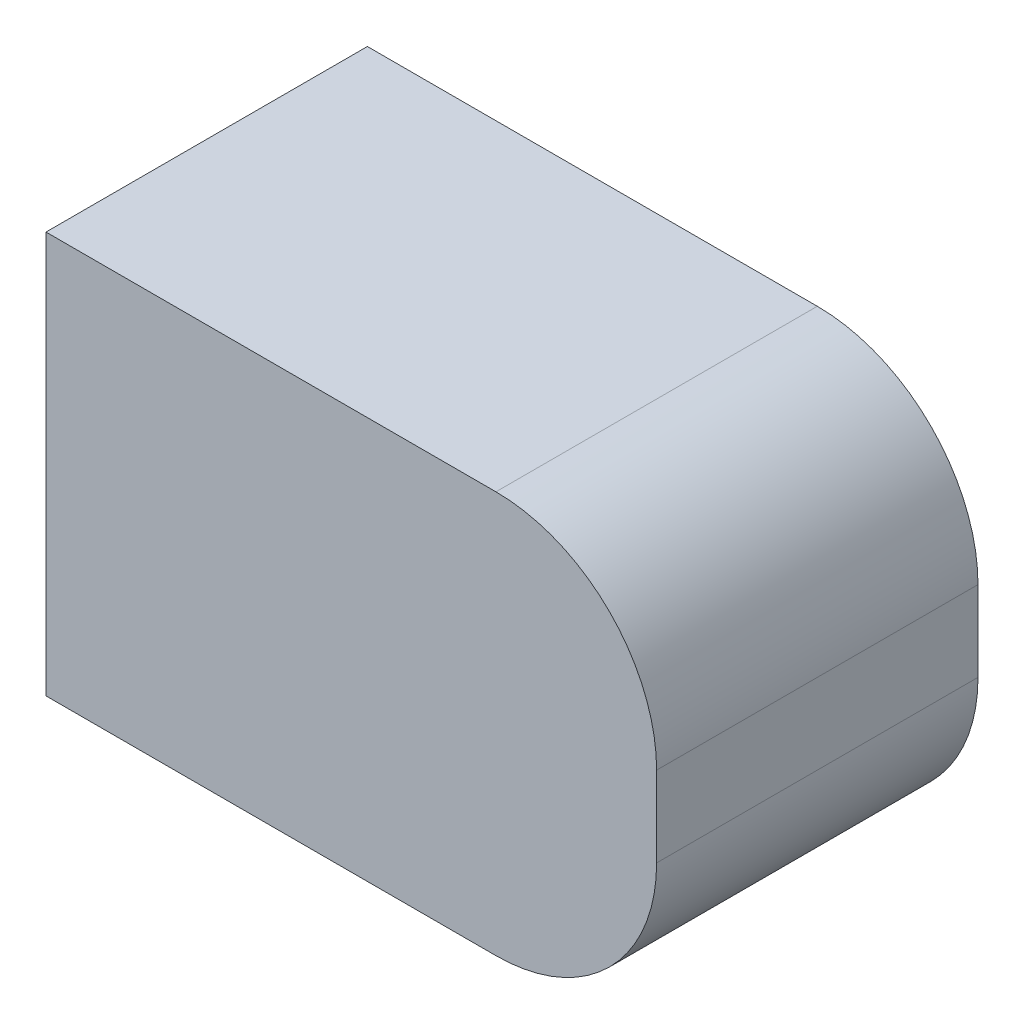
ISO-10303-21;
HEADER;
FILE_DESCRIPTION(('STEP AP214'),'2;1');
FILE_NAME('part.step','',(''),(''),'','','');
FILE_SCHEMA(('AUTOMOTIVE_DESIGN { 1 0 10303 214 1 1 1 1 }'));
ENDSEC;
DATA;
#1=APPLICATION_CONTEXT('core data for automotive mechanical design processes');
#2=APPLICATION_PROTOCOL_DEFINITION('international standard','automotive_design',2000,#1);
#3=PRODUCT_CONTEXT('',#1,'mechanical');
#4=PRODUCT('Part','Part','',(#3));
#5=PRODUCT_RELATED_PRODUCT_CATEGORY('part','',(#4));
#6=PRODUCT_DEFINITION_FORMATION('','',#4);
#7=PRODUCT_DEFINITION_CONTEXT('part definition',#1,'design');
#8=PRODUCT_DEFINITION('design','',#6,#7);
#9=PRODUCT_DEFINITION_SHAPE('','',#8);
#10=(LENGTH_UNIT() NAMED_UNIT(*) SI_UNIT(.MILLI.,.METRE.));
#11=(NAMED_UNIT(*) PLANE_ANGLE_UNIT() SI_UNIT($,.RADIAN.));
#12=(NAMED_UNIT(*) SI_UNIT($,.STERADIAN.) SOLID_ANGLE_UNIT());
#13=UNCERTAINTY_MEASURE_WITH_UNIT(LENGTH_MEASURE(1.E-05),#10,'distance_accuracy_value','');
#14=(GEOMETRIC_REPRESENTATION_CONTEXT(3) GLOBAL_UNCERTAINTY_ASSIGNED_CONTEXT((#13)) GLOBAL_UNIT_ASSIGNED_CONTEXT((#10,
#11,#12)) REPRESENTATION_CONTEXT('',''));
#15=CARTESIAN_POINT('',(0.,0.,0.));
#16=DIRECTION('',(0.,0.,1.));
#17=DIRECTION('',(1.,0.,0.));
#18=AXIS2_PLACEMENT_3D('',#15,#16,#17);
#19=CARTESIAN_POINT('',(-1.223,0.0249999999999996,0.));
#20=DIRECTION('',(0.,0.,1.));
#21=DIRECTION('',(0.707106781186548,0.707106781186547,0.));
#22=AXIS2_PLACEMENT_3D('',#19,#20,#21);
#23=CYLINDRICAL_SURFACE('',#22,0.1);
#24=CARTESIAN_POINT('',(-1.223,0.0249999999999996,0.2));
#25=DIRECTION('',(0.,0.,-1.));
#26=DIRECTION('',(0.707106781186548,0.707106781186547,0.));
#27=AXIS2_PLACEMENT_3D('',#24,#25,#26);
#28=CIRCLE('',#27,0.1);
#29=CARTESIAN_POINT('',(-1.223,0.125,0.2));
#30=VERTEX_POINT('',#29);
#31=CARTESIAN_POINT('',(-1.123,0.0249999999999996,0.2));
#32=VERTEX_POINT('',#31);
#33=EDGE_CURVE('E11',#30,#32,#28,.T.);
#34=ORIENTED_EDGE('',*,*,#33,.T.);
#35=DIRECTION('',(0.,0.,-1.));
#36=VECTOR('',#35,1.);
#37=CARTESIAN_POINT('',(-1.123,0.0249999999999996,0.));
#38=LINE('',#37,#36);
#39=CARTESIAN_POINT('',(-1.123,0.0249999999999996,0.));
#40=VERTEX_POINT('',#39);
#41=EDGE_CURVE('E24',#32,#40,#38,.T.);
#42=ORIENTED_EDGE('',*,*,#41,.T.);
#43=CARTESIAN_POINT('',(-1.223,0.0249999999999996,0.));
#44=DIRECTION('',(0.,0.,1.));
#45=DIRECTION('',(0.707106781186548,0.707106781186547,0.));
#46=AXIS2_PLACEMENT_3D('',#43,#44,#45);
#47=CIRCLE('',#46,0.1);
#48=CARTESIAN_POINT('',(-1.223,0.125,0.));
#49=VERTEX_POINT('',#48);
#50=EDGE_CURVE('E115',#40,#49,#47,.T.);
#51=ORIENTED_EDGE('',*,*,#50,.T.);
#52=DIRECTION('',(0.,0.,1.));
#53=VECTOR('',#52,1.);
#54=CARTESIAN_POINT('',(-1.223,0.125,0.));
#55=LINE('',#54,#53);
#56=EDGE_CURVE('E113',#49,#30,#55,.T.);
#57=ORIENTED_EDGE('',*,*,#56,.T.);
#58=EDGE_LOOP('',(#34,#42,#51,#57));
#59=FACE_BOUND('',#58,.T.);
#60=ADVANCED_FACE('F17',(#59),#23,.T.);
#61=CARTESIAN_POINT('',(-1.313,0.,0.));
#62=DIRECTION('',(0.,0.,1.));
#63=DIRECTION('',(1.,0.,0.));
#64=AXIS2_PLACEMENT_3D('',#61,#62,#63);
#65=PLANE('',#64);
#66=ORIENTED_EDGE('',*,*,#50,.F.);
#67=DIRECTION('',(0.,1.,0.));
#68=VECTOR('',#67,1.);
#69=CARTESIAN_POINT('',(-1.123,-0.125,0.));
#70=LINE('',#69,#68);
#71=CARTESIAN_POINT('',(-1.123,-0.0249999999999859,0.));
#72=VERTEX_POINT('',#71);
#73=EDGE_CURVE('E110',#72,#40,#70,.T.);
#74=ORIENTED_EDGE('',*,*,#73,.F.);
#75=CARTESIAN_POINT('',(-1.223,-0.0249999999999859,0.));
#76=DIRECTION('',(0.,0.,1.));
#77=DIRECTION('',(0.707106781186565,-0.70710678118653,0.));
#78=AXIS2_PLACEMENT_3D('',#75,#76,#77);
#79=CIRCLE('',#78,0.1);
#80=CARTESIAN_POINT('',(-1.223,-0.124999999999986,0.));
#81=VERTEX_POINT('',#80);
#82=EDGE_CURVE('E107',#81,#72,#79,.T.);
#83=ORIENTED_EDGE('',*,*,#82,.F.);
#84=DIRECTION('',(1.,0.,0.));
#85=VECTOR('',#84,1.);
#86=CARTESIAN_POINT('',(-1.503,-0.125,0.));
#87=LINE('',#86,#85);
#88=CARTESIAN_POINT('',(-1.503,-0.125,0.));
#89=VERTEX_POINT('',#88);
#90=EDGE_CURVE('E105',#89,#81,#87,.T.);
#91=ORIENTED_EDGE('',*,*,#90,.F.);
#92=DIRECTION('',(0.,-1.,0.));
#93=VECTOR('',#92,1.);
#94=CARTESIAN_POINT('',(-1.503,0.125,0.));
#95=LINE('',#94,#93);
#96=CARTESIAN_POINT('',(-1.503,0.125,0.));
#97=VERTEX_POINT('',#96);
#98=EDGE_CURVE('E84',#97,#89,#95,.T.);
#99=ORIENTED_EDGE('',*,*,#98,.F.);
#100=DIRECTION('',(-1.,0.,0.));
#101=VECTOR('',#100,1.);
#102=CARTESIAN_POINT('',(-1.123,0.125,0.));
#103=LINE('',#102,#101);
#104=EDGE_CURVE('E101',#49,#97,#103,.T.);
#105=ORIENTED_EDGE('',*,*,#104,.F.);
#106=EDGE_LOOP('',(#66,#74,#83,#91,#99,#105));
#107=FACE_BOUND('',#106,.T.);
#108=ADVANCED_FACE('F121',(#107),#65,.F.);
#109=CARTESIAN_POINT('',(-1.123,-0.125,0.));
#110=DIRECTION('',(1.,0.,0.));
#111=DIRECTION('',(0.,1.,0.));
#112=AXIS2_PLACEMENT_3D('',#109,#110,#111);
#113=PLANE('',#112);
#114=ORIENTED_EDGE('',*,*,#41,.F.);
#115=DIRECTION('',(0.,1.,0.));
#116=VECTOR('',#115,1.);
#117=CARTESIAN_POINT('',(-1.123,-0.125,0.2));
#118=LINE('',#117,#116);
#119=CARTESIAN_POINT('',(-1.123,-0.0249999999999859,0.2));
#120=VERTEX_POINT('',#119);
#121=EDGE_CURVE('E99',#120,#32,#118,.T.);
#122=ORIENTED_EDGE('',*,*,#121,.F.);
#123=DIRECTION('',(0.,0.,1.));
#124=VECTOR('',#123,1.);
#125=CARTESIAN_POINT('',(-1.123,-0.0249999999999859,0.));
#126=LINE('',#125,#124);
#127=EDGE_CURVE('E96',#72,#120,#126,.T.);
#128=ORIENTED_EDGE('',*,*,#127,.F.);
#129=ORIENTED_EDGE('',*,*,#73,.T.);
#130=EDGE_LOOP('',(#114,#122,#128,#129));
#131=FACE_BOUND('',#130,.T.);
#132=ADVANCED_FACE('F123',(#131),#113,.T.);
#133=CARTESIAN_POINT('',(-1.223,-0.0249999999999859,0.));
#134=DIRECTION('',(0.,0.,1.));
#135=DIRECTION('',(0.707106781186565,-0.70710678118653,0.));
#136=AXIS2_PLACEMENT_3D('',#133,#134,#135);
#137=CYLINDRICAL_SURFACE('',#136,0.1);
#138=CARTESIAN_POINT('',(-1.223,-0.0249999999999859,0.2));
#139=DIRECTION('',(0.,0.,-1.));
#140=DIRECTION('',(0.707106781186565,-0.70710678118653,0.));
#141=AXIS2_PLACEMENT_3D('',#138,#139,#140);
#142=CIRCLE('',#141,0.1);
#143=CARTESIAN_POINT('',(-1.223,-0.124999999999986,0.2));
#144=VERTEX_POINT('',#143);
#145=EDGE_CURVE('E94',#120,#144,#142,.T.);
#146=ORIENTED_EDGE('',*,*,#145,.T.);
#147=DIRECTION('',(0.,0.,-1.));
#148=VECTOR('',#147,1.);
#149=CARTESIAN_POINT('',(-1.223,-0.124999999999986,0.));
#150=LINE('',#149,#148);
#151=EDGE_CURVE('E73',#144,#81,#150,.T.);
#152=ORIENTED_EDGE('',*,*,#151,.T.);
#153=ORIENTED_EDGE('',*,*,#82,.T.);
#154=ORIENTED_EDGE('',*,*,#127,.T.);
#155=EDGE_LOOP('',(#146,#152,#153,#154));
#156=FACE_BOUND('',#155,.T.);
#157=ADVANCED_FACE('F125',(#156),#137,.T.);
#158=CARTESIAN_POINT('',(-1.123,0.125,0.));
#159=DIRECTION('',(0.,1.,0.));
#160=DIRECTION('',(-1.,0.,0.));
#161=AXIS2_PLACEMENT_3D('',#158,#159,#160);
#162=PLANE('',#161);
#163=ORIENTED_EDGE('',*,*,#56,.F.);
#164=ORIENTED_EDGE('',*,*,#104,.T.);
#165=DIRECTION('',(0.,0.,1.));
#166=VECTOR('',#165,1.);
#167=CARTESIAN_POINT('',(-1.503,0.125,0.));
#168=LINE('',#167,#166);
#169=CARTESIAN_POINT('',(-1.503,0.125,0.2));
#170=VERTEX_POINT('',#169);
#171=EDGE_CURVE('E91',#97,#170,#168,.T.);
#172=ORIENTED_EDGE('',*,*,#171,.T.);
#173=DIRECTION('',(-1.,0.,0.));
#174=VECTOR('',#173,1.);
#175=CARTESIAN_POINT('',(-1.123,0.125,0.2));
#176=LINE('',#175,#174);
#177=EDGE_CURVE('E76',#30,#170,#176,.T.);
#178=ORIENTED_EDGE('',*,*,#177,.F.);
#179=EDGE_LOOP('',(#163,#164,#172,#178));
#180=FACE_BOUND('',#179,.T.);
#181=ADVANCED_FACE('F127',(#180),#162,.T.);
#182=CARTESIAN_POINT('',(-1.503,-0.125,0.));
#183=DIRECTION('',(0.,-1.,0.));
#184=DIRECTION('',(1.,0.,0.));
#185=AXIS2_PLACEMENT_3D('',#182,#183,#184);
#186=PLANE('',#185);
#187=ORIENTED_EDGE('',*,*,#151,.F.);
#188=DIRECTION('',(1.,0.,0.));
#189=VECTOR('',#188,1.);
#190=CARTESIAN_POINT('',(-1.503,-0.125,0.2));
#191=LINE('',#190,#189);
#192=CARTESIAN_POINT('',(-1.503,-0.125,0.2));
#193=VERTEX_POINT('',#192);
#194=EDGE_CURVE('E67',#193,#144,#191,.T.);
#195=ORIENTED_EDGE('',*,*,#194,.F.);
#196=DIRECTION('',(0.,0.,1.));
#197=VECTOR('',#196,1.);
#198=CARTESIAN_POINT('',(-1.503,-0.125,0.));
#199=LINE('',#198,#197);
#200=EDGE_CURVE('E71',#89,#193,#199,.T.);
#201=ORIENTED_EDGE('',*,*,#200,.F.);
#202=ORIENTED_EDGE('',*,*,#90,.T.);
#203=EDGE_LOOP('',(#187,#195,#201,#202));
#204=FACE_BOUND('',#203,.T.);
#205=ADVANCED_FACE('F69',(#204),#186,.T.);
#206=CARTESIAN_POINT('',(-1.503,0.125,0.));
#207=DIRECTION('',(-1.,0.,0.));
#208=DIRECTION('',(0.,-1.,0.));
#209=AXIS2_PLACEMENT_3D('',#206,#207,#208);
#210=PLANE('',#209);
#211=ORIENTED_EDGE('',*,*,#98,.T.);
#212=ORIENTED_EDGE('',*,*,#200,.T.);
#213=DIRECTION('',(0.,-1.,0.));
#214=VECTOR('',#213,1.);
#215=CARTESIAN_POINT('',(-1.503,0.125,0.2));
#216=LINE('',#215,#214);
#217=EDGE_CURVE('E83',#170,#193,#216,.T.);
#218=ORIENTED_EDGE('',*,*,#217,.F.);
#219=ORIENTED_EDGE('',*,*,#171,.F.);
#220=EDGE_LOOP('',(#211,#212,#218,#219));
#221=FACE_BOUND('',#220,.T.);
#222=ADVANCED_FACE('F81',(#221),#210,.T.);
#223=CARTESIAN_POINT('',(-1.313,0.,0.2));
#224=DIRECTION('',(0.,0.,1.));
#225=DIRECTION('',(1.,0.,0.));
#226=AXIS2_PLACEMENT_3D('',#223,#224,#225);
#227=PLANE('',#226);
#228=ORIENTED_EDGE('',*,*,#33,.F.);
#229=ORIENTED_EDGE('',*,*,#177,.T.);
#230=ORIENTED_EDGE('',*,*,#217,.T.);
#231=ORIENTED_EDGE('',*,*,#194,.T.);
#232=ORIENTED_EDGE('',*,*,#145,.F.);
#233=ORIENTED_EDGE('',*,*,#121,.T.);
#234=EDGE_LOOP('',(#228,#229,#230,#231,#232,#233));
#235=FACE_BOUND('',#234,.T.);
#236=ADVANCED_FACE('F86',(#235),#227,.T.);
#237=CLOSED_SHELL('',(#60,#108,#132,#157,#181,#205,#222,#236));
#238=MANIFOLD_SOLID_BREP('B1',#237);
#239=ADVANCED_BREP_SHAPE_REPRESENTATION('',(#18,#238),#14);
#240=SHAPE_DEFINITION_REPRESENTATION(#9,#239);
ENDSEC;
END-ISO-10303-21;
